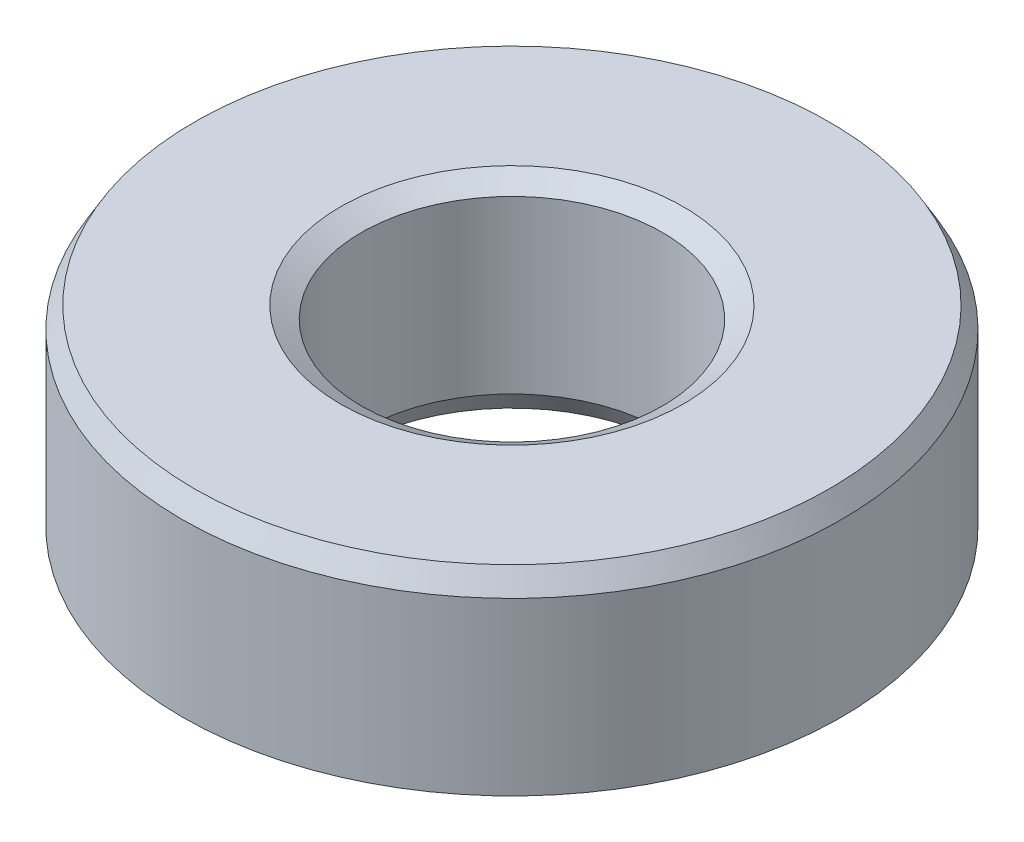
ISO-10303-21;
HEADER;
FILE_DESCRIPTION(('STEP AP214'),'2;1');
FILE_NAME('part.step','',(''),(''),'','','');
FILE_SCHEMA(('AUTOMOTIVE_DESIGN { 1 0 10303 214 1 1 1 1 }'));
ENDSEC;
DATA;
#1=APPLICATION_CONTEXT('core data for automotive mechanical design processes');
#2=APPLICATION_PROTOCOL_DEFINITION('international standard','automotive_design',2000,#1);
#3=PRODUCT_CONTEXT('',#1,'mechanical');
#4=PRODUCT('Part','Part','',(#3));
#5=PRODUCT_RELATED_PRODUCT_CATEGORY('part','',(#4));
#6=PRODUCT_DEFINITION_FORMATION('','',#4);
#7=PRODUCT_DEFINITION_CONTEXT('part definition',#1,'design');
#8=PRODUCT_DEFINITION('design','',#6,#7);
#9=PRODUCT_DEFINITION_SHAPE('','',#8);
#10=(LENGTH_UNIT() NAMED_UNIT(*) SI_UNIT(.MILLI.,.METRE.));
#11=(NAMED_UNIT(*) PLANE_ANGLE_UNIT() SI_UNIT($,.RADIAN.));
#12=(NAMED_UNIT(*) SI_UNIT($,.STERADIAN.) SOLID_ANGLE_UNIT());
#13=UNCERTAINTY_MEASURE_WITH_UNIT(LENGTH_MEASURE(1.E-05),#10,'distance_accuracy_value','');
#14=(GEOMETRIC_REPRESENTATION_CONTEXT(3) GLOBAL_UNCERTAINTY_ASSIGNED_CONTEXT((#13)) GLOBAL_UNIT_ASSIGNED_CONTEXT((#10,
#11,#12)) REPRESENTATION_CONTEXT('',''));
#15=CARTESIAN_POINT('',(0.,0.,0.));
#16=DIRECTION('',(0.,0.,1.));
#17=DIRECTION('',(1.,0.,0.));
#18=AXIS2_PLACEMENT_3D('',#15,#16,#17);
#19=CARTESIAN_POINT('',(0.,12.3677719834396,0.));
#20=DIRECTION('',(0.,-1.,0.));
#21=DIRECTION('',(0.,0.,-1.));
#22=AXIS2_PLACEMENT_3D('',#19,#20,#21);
#23=CYLINDRICAL_SURFACE('',#22,20.);
#24=CARTESIAN_POINT('',(0.,0.726825050652361,0.));
#25=DIRECTION('',(0.,1.,0.));
#26=DIRECTION('',(0.,0.,1.));
#27=AXIS2_PLACEMENT_3D('',#24,#25,#26);
#28=CIRCLE('',#27,20.);
#29=CARTESIAN_POINT('',(0.,0.726825050652361,20.));
#30=VERTEX_POINT('',#29);
#31=EDGE_CURVE('E10',#30,#30,#28,.T.);
#32=ORIENTED_EDGE('',*,*,#31,.T.);
#33=EDGE_LOOP('',(#32));
#34=FACE_BOUND('',#33,.T.);
#35=CARTESIAN_POINT('',(0.,11.1088740674958,0.));
#36=DIRECTION('',(0.,1.,0.));
#37=DIRECTION('',(0.,0.,1.));
#38=AXIS2_PLACEMENT_3D('',#35,#36,#37);
#39=CIRCLE('',#38,20.);
#40=CARTESIAN_POINT('',(0.,11.1088740674958,20.));
#41=VERTEX_POINT('',#40);
#42=EDGE_CURVE('E50',#41,#41,#39,.F.);
#43=ORIENTED_EDGE('',*,*,#42,.T.);
#44=EDGE_LOOP('',(#43));
#45=FACE_BOUND('',#44,.T.);
#46=ADVANCED_FACE('F39',(#34,#45),#23,.T.);
#47=CARTESIAN_POINT('',(0.,12.3677719834396,0.));
#48=DIRECTION('',(0.,1.,0.));
#49=DIRECTION('',(0.,0.,1.));
#50=AXIS2_PLACEMENT_3D('',#47,#48,#49);
#51=PLANE('',#50);
#52=CARTESIAN_POINT('',(0.,12.3677719834396,0.));
#53=DIRECTION('',(0.,1.,0.));
#54=DIRECTION('',(0.,0.,1.));
#55=AXIS2_PLACEMENT_3D('',#52,#53,#54);
#56=CIRCLE('',#55,10.3891920134083);
#57=CARTESIAN_POINT('',(0.,12.3677719834396,10.3891920134083));
#58=VERTEX_POINT('',#57);
#59=EDGE_CURVE('E58',#58,#58,#56,.F.);
#60=ORIENTED_EDGE('',*,*,#59,.T.);
#61=EDGE_LOOP('',(#60));
#62=FACE_BOUND('',#61,.T.);
#63=CARTESIAN_POINT('',(0.,12.3677719834396,0.));
#64=DIRECTION('',(0.,1.,0.));
#65=DIRECTION('',(0.,0.,1.));
#66=AXIS2_PLACEMENT_3D('',#63,#64,#65);
#67=CIRCLE('',#66,19.2731749493476);
#68=CARTESIAN_POINT('',(0.,12.3677719834396,19.2731749493476));
#69=VERTEX_POINT('',#68);
#70=EDGE_CURVE('E61',#69,#69,#67,.T.);
#71=ORIENTED_EDGE('',*,*,#70,.T.);
#72=EDGE_LOOP('',(#71));
#73=FACE_BOUND('',#72,.T.);
#74=ADVANCED_FACE('F88',(#62,#73),#51,.T.);
#75=CARTESIAN_POINT('',(0.,0.,0.));
#76=DIRECTION('',(0.,1.,0.));
#77=DIRECTION('',(0.,0.,1.));
#78=AXIS2_PLACEMENT_3D('',#75,#76,#77);
#79=PLANE('',#78);
#80=CARTESIAN_POINT('',(0.,0.,0.));
#81=DIRECTION('',(0.,1.,0.));
#82=DIRECTION('',(0.,0.,1.));
#83=AXIS2_PLACEMENT_3D('',#80,#81,#82);
#84=CIRCLE('',#83,9.85711914811692);
#85=CARTESIAN_POINT('',(0.,0.,9.85711914811692));
#86=VERTEX_POINT('',#85);
#87=EDGE_CURVE('E51',#86,#86,#84,.T.);
#88=ORIENTED_EDGE('',*,*,#87,.T.);
#89=EDGE_LOOP('',(#88));
#90=FACE_BOUND('',#89,.T.);
#91=CARTESIAN_POINT('',(0.,0.,0.));
#92=DIRECTION('',(0.,1.,0.));
#93=DIRECTION('',(0.,0.,1.));
#94=AXIS2_PLACEMENT_3D('',#91,#92,#93);
#95=CIRCLE('',#94,18.7411020840563);
#96=CARTESIAN_POINT('',(0.,0.,18.7411020840563));
#97=VERTEX_POINT('',#96);
#98=EDGE_CURVE('E54',#97,#97,#95,.F.);
#99=ORIENTED_EDGE('',*,*,#98,.T.);
#100=EDGE_LOOP('',(#99));
#101=FACE_BOUND('',#100,.T.);
#102=ADVANCED_FACE('F83',(#90,#101),#79,.F.);
#103=CARTESIAN_POINT('',(0.,12.3677719834396,0.));
#104=DIRECTION('',(0.,-1.,0.));
#105=DIRECTION('',(0.,0.,-1.));
#106=AXIS2_PLACEMENT_3D('',#103,#104,#105);
#107=CYLINDRICAL_SURFACE('',#106,9.13029409746455);
#108=CARTESIAN_POINT('',(0.,11.6409469327872,0.));
#109=DIRECTION('',(0.,1.,0.));
#110=DIRECTION('',(0.,0.,1.));
#111=AXIS2_PLACEMENT_3D('',#108,#109,#110);
#112=CIRCLE('',#111,9.13029409746455);
#113=CARTESIAN_POINT('',(0.,11.6409469327872,9.13029409746455));
#114=VERTEX_POINT('',#113);
#115=EDGE_CURVE('E67',#114,#114,#112,.T.);
#116=ORIENTED_EDGE('',*,*,#115,.T.);
#117=EDGE_LOOP('',(#116));
#118=FACE_BOUND('',#117,.T.);
#119=CARTESIAN_POINT('',(0.,1.25889791594373,0.));
#120=DIRECTION('',(0.,1.,0.));
#121=DIRECTION('',(0.,0.,1.));
#122=AXIS2_PLACEMENT_3D('',#119,#120,#121);
#123=CIRCLE('',#122,9.13029409746455);
#124=CARTESIAN_POINT('',(0.,1.25889791594373,9.13029409746455));
#125=VERTEX_POINT('',#124);
#126=EDGE_CURVE('E69',#125,#125,#123,.F.);
#127=ORIENTED_EDGE('',*,*,#126,.T.);
#128=EDGE_LOOP('',(#127));
#129=FACE_BOUND('',#128,.T.);
#130=ADVANCED_FACE('F71',(#118,#129),#107,.F.);
#131=CARTESIAN_POINT('',(0.,11.6409469327872,0.));
#132=DIRECTION('',(0.,1.,0.));
#133=DIRECTION('',(0.,0.,1.));
#134=AXIS2_PLACEMENT_3D('',#131,#132,#133);
#135=CONICAL_SURFACE('',#134,9.13029409746455,1.0471975511966);
#136=ORIENTED_EDGE('',*,*,#59,.F.);
#137=EDGE_LOOP('',(#136));
#138=FACE_BOUND('',#137,.T.);
#139=ORIENTED_EDGE('',*,*,#115,.F.);
#140=EDGE_LOOP('',(#139));
#141=FACE_BOUND('',#140,.T.);
#142=ADVANCED_FACE('F77',(#138,#141),#135,.F.);
#143=CARTESIAN_POINT('',(0.,0.,0.));
#144=DIRECTION('',(0.,-1.,0.));
#145=DIRECTION('',(0.,0.,-1.));
#146=AXIS2_PLACEMENT_3D('',#143,#144,#145);
#147=CONICAL_SURFACE('',#146,9.85711914811692,0.523598775598293);
#148=ORIENTED_EDGE('',*,*,#126,.F.);
#149=EDGE_LOOP('',(#148));
#150=FACE_BOUND('',#149,.T.);
#151=ORIENTED_EDGE('',*,*,#87,.F.);
#152=EDGE_LOOP('',(#151));
#153=FACE_BOUND('',#152,.T.);
#154=ADVANCED_FACE('F73',(#150,#153),#147,.F.);
#155=CARTESIAN_POINT('',(0.,0.726825050652361,0.));
#156=DIRECTION('',(0.,1.,0.));
#157=DIRECTION('',(0.,0.,1.));
#158=AXIS2_PLACEMENT_3D('',#155,#156,#157);
#159=CONICAL_SURFACE('',#158,20.,1.0471975511966);
#160=ORIENTED_EDGE('',*,*,#98,.F.);
#161=EDGE_LOOP('',(#160));
#162=FACE_BOUND('',#161,.T.);
#163=ORIENTED_EDGE('',*,*,#31,.F.);
#164=EDGE_LOOP('',(#163));
#165=FACE_BOUND('',#164,.T.);
#166=ADVANCED_FACE('F76',(#162,#165),#159,.T.);
#167=CARTESIAN_POINT('',(0.,12.3677719834396,0.));
#168=DIRECTION('',(0.,-1.,0.));
#169=DIRECTION('',(0.,0.,-1.));
#170=AXIS2_PLACEMENT_3D('',#167,#168,#169);
#171=CONICAL_SURFACE('',#170,19.2731749493476,0.523598775598298);
#172=ORIENTED_EDGE('',*,*,#42,.F.);
#173=EDGE_LOOP('',(#172));
#174=FACE_BOUND('',#173,.T.);
#175=ORIENTED_EDGE('',*,*,#70,.F.);
#176=EDGE_LOOP('',(#175));
#177=FACE_BOUND('',#176,.T.);
#178=ADVANCED_FACE('F45',(#174,#177),#171,.T.);
#179=CLOSED_SHELL('',(#46,#74,#102,#130,#142,#154,#166,#178));
#180=MANIFOLD_SOLID_BREP('B2',#179);
#181=ADVANCED_BREP_SHAPE_REPRESENTATION('',(#18,#180),#14);
#182=SHAPE_DEFINITION_REPRESENTATION(#9,#181);
ENDSEC;
END-ISO-10303-21;
